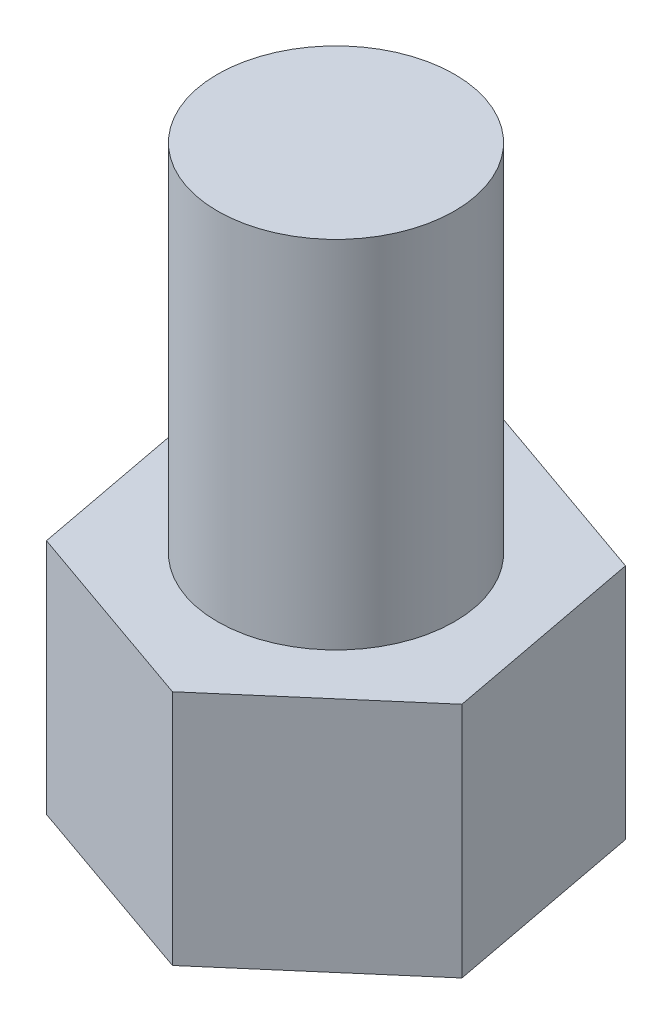
ISO-10303-21;
HEADER;
FILE_DESCRIPTION(('STEP AP214'),'2;1');
FILE_NAME('part.step','',(''),(''),'','','');
FILE_SCHEMA(('AUTOMOTIVE_DESIGN { 1 0 10303 214 1 1 1 1 }'));
ENDSEC;
DATA;
#1=APPLICATION_CONTEXT('core data for automotive mechanical design processes');
#2=APPLICATION_PROTOCOL_DEFINITION('international standard','automotive_design',2000,#1);
#3=PRODUCT_CONTEXT('',#1,'mechanical');
#4=PRODUCT('Part','Part','',(#3));
#5=PRODUCT_RELATED_PRODUCT_CATEGORY('part','',(#4));
#6=PRODUCT_DEFINITION_FORMATION('','',#4);
#7=PRODUCT_DEFINITION_CONTEXT('part definition',#1,'design');
#8=PRODUCT_DEFINITION('design','',#6,#7);
#9=PRODUCT_DEFINITION_SHAPE('','',#8);
#10=(LENGTH_UNIT() NAMED_UNIT(*) SI_UNIT(.MILLI.,.METRE.));
#11=(NAMED_UNIT(*) PLANE_ANGLE_UNIT() SI_UNIT($,.RADIAN.));
#12=(NAMED_UNIT(*) SI_UNIT($,.STERADIAN.) SOLID_ANGLE_UNIT());
#13=UNCERTAINTY_MEASURE_WITH_UNIT(LENGTH_MEASURE(1.E-05),#10,'distance_accuracy_value','');
#14=(GEOMETRIC_REPRESENTATION_CONTEXT(3) GLOBAL_UNCERTAINTY_ASSIGNED_CONTEXT((#13)) GLOBAL_UNIT_ASSIGNED_CONTEXT((#10,
#11,#12)) REPRESENTATION_CONTEXT('',''));
#15=CARTESIAN_POINT('',(0.,0.,0.));
#16=DIRECTION('',(0.,0.,1.));
#17=DIRECTION('',(1.,0.,0.));
#18=AXIS2_PLACEMENT_3D('',#15,#16,#17);
#19=CARTESIAN_POINT('',(0.321879677095041,2.,1.70187939451454));
#20=DIRECTION('',(-0.652230101823146,0.,-0.758021038148526));
#21=DIRECTION('',(-0.758021038148526,0.,0.652230101823146));
#22=AXIS2_PLACEMENT_3D('',#19,#20,#21);
#23=PLANE('',#22);
#24=DIRECTION('',(0.758021038148526,0.,-0.652230101823146));
#25=VECTOR('',#24,1.);
#26=CARTESIAN_POINT('',(0.321879677095041,0.,1.70187939451454));
#27=LINE('',#26,#25);
#28=CARTESIAN_POINT('',(0.321879677095041,0.,1.70187939451454));
#29=VERTEX_POINT('',#28);
#30=CARTESIAN_POINT('',(1.63481062837439,0.,0.572183719931034));
#31=VERTEX_POINT('',#30);
#32=EDGE_CURVE('E118',#29,#31,#27,.T.);
#33=ORIENTED_EDGE('',*,*,#32,.T.);
#34=DIRECTION('',(0.,-1.,0.));
#35=VECTOR('',#34,1.);
#36=CARTESIAN_POINT('',(1.63481062837439,2.,0.572183719931034));
#37=LINE('',#36,#35);
#38=CARTESIAN_POINT('',(1.63481062837439,2.,0.572183719931034));
#39=VERTEX_POINT('',#38);
#40=EDGE_CURVE('E11',#39,#31,#37,.T.);
#41=ORIENTED_EDGE('',*,*,#40,.F.);
#42=DIRECTION('',(0.758021038148526,0.,-0.652230101823146));
#43=VECTOR('',#42,1.);
#44=CARTESIAN_POINT('',(0.321879677095041,2.,1.70187939451454));
#45=LINE('',#44,#43);
#46=CARTESIAN_POINT('',(0.321879677095041,2.,1.70187939451454));
#47=VERTEX_POINT('',#46);
#48=EDGE_CURVE('E129',#47,#39,#45,.T.);
#49=ORIENTED_EDGE('',*,*,#48,.F.);
#50=DIRECTION('',(0.,-1.,0.));
#51=VECTOR('',#50,1.);
#52=CARTESIAN_POINT('',(0.321879677095041,2.,1.70187939451454));
#53=LINE('',#52,#51);
#54=EDGE_CURVE('E114',#47,#29,#53,.T.);
#55=ORIENTED_EDGE('',*,*,#54,.T.);
#56=EDGE_LOOP('',(#33,#41,#49,#55));
#57=FACE_BOUND('',#56,.T.);
#58=ADVANCED_FACE('F34',(#57),#23,.F.);
#59=CARTESIAN_POINT('',(1.63481062837439,2.,0.572183719931034));
#60=DIRECTION('',(-0.98258052655125,0.,0.185837318217492));
#61=DIRECTION('',(0.185837318217492,0.,0.98258052655125));
#62=AXIS2_PLACEMENT_3D('',#59,#60,#61);
#63=PLANE('',#62);
#64=DIRECTION('',(-0.185837318217492,0.,-0.98258052655125));
#65=VECTOR('',#64,1.);
#66=CARTESIAN_POINT('',(1.63481062837439,0.,0.572183719931034));
#67=LINE('',#66,#65);
#68=CARTESIAN_POINT('',(1.31293095127935,0.,-1.12969567458351));
#69=VERTEX_POINT('',#68);
#70=EDGE_CURVE('E121',#31,#69,#67,.T.);
#71=ORIENTED_EDGE('',*,*,#70,.T.);
#72=DIRECTION('',(0.,-1.,0.));
#73=VECTOR('',#72,1.);
#74=CARTESIAN_POINT('',(1.31293095127935,2.,-1.12969567458351));
#75=LINE('',#74,#73);
#76=CARTESIAN_POINT('',(1.31293095127935,2.,-1.12969567458351));
#77=VERTEX_POINT('',#76);
#78=EDGE_CURVE('E42',#77,#69,#75,.T.);
#79=ORIENTED_EDGE('',*,*,#78,.F.);
#80=DIRECTION('',(-0.185837318217492,0.,-0.98258052655125));
#81=VECTOR('',#80,1.);
#82=CARTESIAN_POINT('',(1.63481062837439,2.,0.572183719931034));
#83=LINE('',#82,#81);
#84=EDGE_CURVE('E87',#39,#77,#83,.T.);
#85=ORIENTED_EDGE('',*,*,#84,.F.);
#86=ORIENTED_EDGE('',*,*,#40,.T.);
#87=EDGE_LOOP('',(#71,#79,#85,#86));
#88=FACE_BOUND('',#87,.T.);
#89=ADVANCED_FACE('F154',(#88),#63,.F.);
#90=CARTESIAN_POINT('',(1.31293095127935,2.,-1.12969567458351));
#91=DIRECTION('',(-0.330350424728104,0.,0.943858356366018));
#92=DIRECTION('',(0.943858356366018,0.,0.330350424728104));
#93=AXIS2_PLACEMENT_3D('',#90,#91,#92);
#94=PLANE('',#93);
#95=DIRECTION('',(-0.943858356366018,0.,-0.330350424728104));
#96=VECTOR('',#95,1.);
#97=CARTESIAN_POINT('',(1.31293095127935,0.,-1.12969567458351));
#98=LINE('',#97,#96);
#99=CARTESIAN_POINT('',(-0.321879677095041,0.,-1.70187939451454));
#100=VERTEX_POINT('',#99);
#101=EDGE_CURVE('E124',#69,#100,#98,.T.);
#102=ORIENTED_EDGE('',*,*,#101,.T.);
#103=DIRECTION('',(0.,-1.,0.));
#104=VECTOR('',#103,1.);
#105=CARTESIAN_POINT('',(-0.321879677095041,2.,-1.70187939451454));
#106=LINE('',#105,#104);
#107=CARTESIAN_POINT('',(-0.321879677095041,2.,-1.70187939451454));
#108=VERTEX_POINT('',#107);
#109=EDGE_CURVE('E109',#108,#100,#106,.T.);
#110=ORIENTED_EDGE('',*,*,#109,.F.);
#111=DIRECTION('',(-0.943858356366018,0.,-0.330350424728104));
#112=VECTOR('',#111,1.);
#113=CARTESIAN_POINT('',(1.31293095127935,2.,-1.12969567458351));
#114=LINE('',#113,#112);
#115=EDGE_CURVE('E100',#77,#108,#114,.T.);
#116=ORIENTED_EDGE('',*,*,#115,.F.);
#117=ORIENTED_EDGE('',*,*,#78,.T.);
#118=EDGE_LOOP('',(#102,#110,#116,#117));
#119=FACE_BOUND('',#118,.T.);
#120=ADVANCED_FACE('F135',(#119),#94,.F.);
#121=CARTESIAN_POINT('',(-0.321879677095041,2.,-1.70187939451454));
#122=DIRECTION('',(0.652230101823145,0.,0.758021038148526));
#123=DIRECTION('',(0.758021038148527,0.,-0.652230101823145));
#124=AXIS2_PLACEMENT_3D('',#121,#122,#123);
#125=PLANE('',#124);
#126=DIRECTION('',(-0.758021038148526,0.,0.652230101823145));
#127=VECTOR('',#126,1.);
#128=CARTESIAN_POINT('',(-0.321879677095041,0.,-1.70187939451454));
#129=LINE('',#128,#127);
#130=CARTESIAN_POINT('',(-1.6348106283744,0.,-0.572183719931035));
#131=VERTEX_POINT('',#130);
#132=EDGE_CURVE('E108',#100,#131,#129,.T.);
#133=ORIENTED_EDGE('',*,*,#132,.T.);
#134=DIRECTION('',(0.,-1.,0.));
#135=VECTOR('',#134,1.);
#136=CARTESIAN_POINT('',(-1.6348106283744,2.,-0.572183719931035));
#137=LINE('',#136,#135);
#138=CARTESIAN_POINT('',(-1.6348106283744,2.,-0.572183719931035));
#139=VERTEX_POINT('',#138);
#140=EDGE_CURVE('E105',#139,#131,#137,.T.);
#141=ORIENTED_EDGE('',*,*,#140,.F.);
#142=DIRECTION('',(-0.758021038148526,0.,0.652230101823145));
#143=VECTOR('',#142,1.);
#144=CARTESIAN_POINT('',(-0.321879677095041,2.,-1.70187939451454));
#145=LINE('',#144,#143);
#146=EDGE_CURVE('E94',#108,#139,#145,.T.);
#147=ORIENTED_EDGE('',*,*,#146,.F.);
#148=ORIENTED_EDGE('',*,*,#109,.T.);
#149=EDGE_LOOP('',(#133,#141,#147,#148));
#150=FACE_BOUND('',#149,.T.);
#151=ADVANCED_FACE('F106',(#150),#125,.F.);
#152=CARTESIAN_POINT('',(-1.6348106283744,2.,-0.572183719931035));
#153=DIRECTION('',(0.98258052655125,0.,-0.185837318217492));
#154=DIRECTION('',(-0.185837318217492,0.,-0.98258052655125));
#155=AXIS2_PLACEMENT_3D('',#152,#153,#154);
#156=PLANE('',#155);
#157=DIRECTION('',(0.185837318217492,0.,0.98258052655125));
#158=VECTOR('',#157,1.);
#159=CARTESIAN_POINT('',(-1.6348106283744,0.,-0.572183719931035));
#160=LINE('',#159,#158);
#161=CARTESIAN_POINT('',(-1.31293095127935,0.,1.12969567458351));
#162=VERTEX_POINT('',#161);
#163=EDGE_CURVE('E73',#131,#162,#160,.T.);
#164=ORIENTED_EDGE('',*,*,#163,.T.);
#165=DIRECTION('',(0.,-1.,0.));
#166=VECTOR('',#165,1.);
#167=CARTESIAN_POINT('',(-1.31293095127935,2.,1.12969567458351));
#168=LINE('',#167,#166);
#169=CARTESIAN_POINT('',(-1.31293095127935,2.,1.12969567458351));
#170=VERTEX_POINT('',#169);
#171=EDGE_CURVE('E110',#170,#162,#168,.T.);
#172=ORIENTED_EDGE('',*,*,#171,.F.);
#173=DIRECTION('',(0.185837318217492,0.,0.98258052655125));
#174=VECTOR('',#173,1.);
#175=CARTESIAN_POINT('',(-1.6348106283744,2.,-0.572183719931035));
#176=LINE('',#175,#174);
#177=EDGE_CURVE('E98',#139,#170,#176,.T.);
#178=ORIENTED_EDGE('',*,*,#177,.F.);
#179=ORIENTED_EDGE('',*,*,#140,.T.);
#180=EDGE_LOOP('',(#164,#172,#178,#179));
#181=FACE_BOUND('',#180,.T.);
#182=ADVANCED_FACE('F112',(#181),#156,.F.);
#183=CARTESIAN_POINT('',(-1.31293095127935,2.,1.12969567458351));
#184=DIRECTION('',(0.330350424728104,0.,-0.943858356366018));
#185=DIRECTION('',(-0.943858356366018,0.,-0.330350424728104));
#186=AXIS2_PLACEMENT_3D('',#183,#184,#185);
#187=PLANE('',#186);
#188=DIRECTION('',(0.943858356366018,0.,0.330350424728104));
#189=VECTOR('',#188,1.);
#190=CARTESIAN_POINT('',(-1.31293095127935,0.,1.12969567458351));
#191=LINE('',#190,#189);
#192=EDGE_CURVE('E79',#162,#29,#191,.T.);
#193=ORIENTED_EDGE('',*,*,#192,.T.);
#194=ORIENTED_EDGE('',*,*,#54,.F.);
#195=DIRECTION('',(0.943858356366018,0.,0.330350424728104));
#196=VECTOR('',#195,1.);
#197=CARTESIAN_POINT('',(-1.31293095127935,2.,1.12969567458351));
#198=LINE('',#197,#196);
#199=EDGE_CURVE('E50',#170,#47,#198,.T.);
#200=ORIENTED_EDGE('',*,*,#199,.F.);
#201=ORIENTED_EDGE('',*,*,#171,.T.);
#202=EDGE_LOOP('',(#193,#194,#200,#201));
#203=FACE_BOUND('',#202,.T.);
#204=ADVANCED_FACE('F142',(#203),#187,.F.);
#205=CARTESIAN_POINT('',(0.,2.,0.));
#206=DIRECTION('',(0.,1.,0.));
#207=DIRECTION('',(0.,0.,1.));
#208=AXIS2_PLACEMENT_3D('',#205,#206,#207);
#209=PLANE('',#208);
#210=CARTESIAN_POINT('',(0.,2.,0.));
#211=DIRECTION('',(0.,1.,0.));
#212=DIRECTION('',(0.,0.,1.));
#213=AXIS2_PLACEMENT_3D('',#210,#211,#212);
#214=CIRCLE('',#213,1.);
#215=CARTESIAN_POINT('',(0.,2.,1.));
#216=VERTEX_POINT('',#215);
#217=EDGE_CURVE('E215',#216,#216,#214,.T.);
#218=ORIENTED_EDGE('',*,*,#217,.F.);
#219=EDGE_LOOP('',(#218));
#220=FACE_BOUND('',#219,.T.);
#221=ORIENTED_EDGE('',*,*,#48,.T.);
#222=ORIENTED_EDGE('',*,*,#84,.T.);
#223=ORIENTED_EDGE('',*,*,#115,.T.);
#224=ORIENTED_EDGE('',*,*,#146,.T.);
#225=ORIENTED_EDGE('',*,*,#177,.T.);
#226=ORIENTED_EDGE('',*,*,#199,.T.);
#227=EDGE_LOOP('',(#221,#222,#223,#224,#225,#226));
#228=FACE_BOUND('',#227,.T.);
#229=ADVANCED_FACE('F96',(#220,#228),#209,.T.);
#230=CARTESIAN_POINT('',(0.,0.,0.));
#231=DIRECTION('',(0.,1.,0.));
#232=DIRECTION('',(0.,0.,1.));
#233=AXIS2_PLACEMENT_3D('',#230,#231,#232);
#234=PLANE('',#233);
#235=ORIENTED_EDGE('',*,*,#32,.F.);
#236=ORIENTED_EDGE('',*,*,#192,.F.);
#237=ORIENTED_EDGE('',*,*,#163,.F.);
#238=ORIENTED_EDGE('',*,*,#132,.F.);
#239=ORIENTED_EDGE('',*,*,#101,.F.);
#240=ORIENTED_EDGE('',*,*,#70,.F.);
#241=EDGE_LOOP('',(#235,#236,#237,#238,#239,#240));
#242=FACE_BOUND('',#241,.T.);
#243=ADVANCED_FACE('F138',(#242),#234,.F.);
#244=CARTESIAN_POINT('',(0.,5.,0.));
#245=DIRECTION('',(0.,-1.,0.));
#246=DIRECTION('',(0.,0.,-1.));
#247=AXIS2_PLACEMENT_3D('',#244,#245,#246);
#248=CYLINDRICAL_SURFACE('',#247,1.);
#249=CARTESIAN_POINT('',(0.,5.,0.));
#250=DIRECTION('',(0.,1.,0.));
#251=DIRECTION('',(0.,0.,1.));
#252=AXIS2_PLACEMENT_3D('',#249,#250,#251);
#253=CIRCLE('',#252,1.);
#254=CARTESIAN_POINT('',(0.,5.,1.));
#255=VERTEX_POINT('',#254);
#256=EDGE_CURVE('E122',#255,#255,#253,.T.);
#257=ORIENTED_EDGE('',*,*,#256,.F.);
#258=EDGE_LOOP('',(#257));
#259=FACE_BOUND('',#258,.T.);
#260=ORIENTED_EDGE('',*,*,#217,.T.);
#261=EDGE_LOOP('',(#260));
#262=FACE_BOUND('',#261,.T.);
#263=ADVANCED_FACE('F186',(#259,#262),#248,.T.);
#264=CARTESIAN_POINT('',(0.,5.,0.));
#265=DIRECTION('',(0.,1.,0.));
#266=DIRECTION('',(0.,0.,1.));
#267=AXIS2_PLACEMENT_3D('',#264,#265,#266);
#268=PLANE('',#267);
#269=ORIENTED_EDGE('',*,*,#256,.T.);
#270=EDGE_LOOP('',(#269));
#271=FACE_BOUND('',#270,.T.);
#272=ADVANCED_FACE('F199',(#271),#268,.T.);
#273=CLOSED_SHELL('',(#58,#89,#120,#151,#182,#204,#229,#243,#263,#272));
#274=MANIFOLD_SOLID_BREP('B2',#273);
#275=ADVANCED_BREP_SHAPE_REPRESENTATION('',(#18,#274),#14);
#276=SHAPE_DEFINITION_REPRESENTATION(#9,#275);
ENDSEC;
END-ISO-10303-21;
